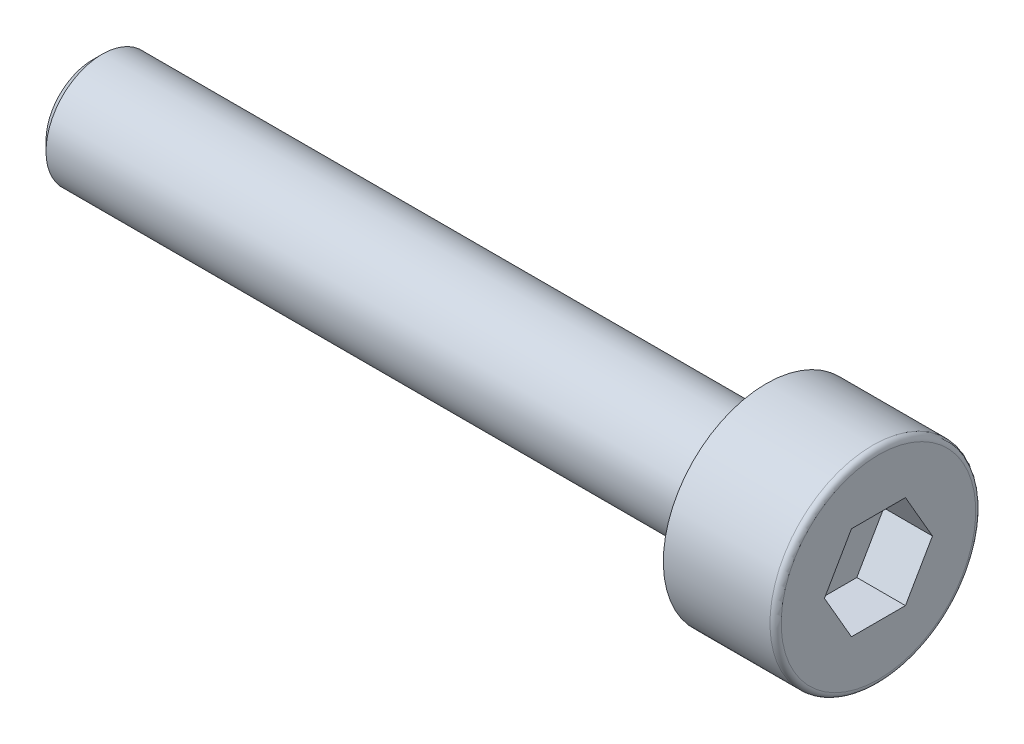
ISO-10303-21;
HEADER;
FILE_DESCRIPTION(('STEP AP214'),'2;1');
FILE_NAME('part.step','',(''),(''),'','','');
FILE_SCHEMA(('AUTOMOTIVE_DESIGN { 1 0 10303 214 1 1 1 1 }'));
ENDSEC;
DATA;
#1=APPLICATION_CONTEXT('core data for automotive mechanical design processes');
#2=APPLICATION_PROTOCOL_DEFINITION('international standard','automotive_design',2000,#1);
#3=PRODUCT_CONTEXT('',#1,'mechanical');
#4=PRODUCT('Part','Part','',(#3));
#5=PRODUCT_RELATED_PRODUCT_CATEGORY('part','',(#4));
#6=PRODUCT_DEFINITION_FORMATION('','',#4);
#7=PRODUCT_DEFINITION_CONTEXT('part definition',#1,'design');
#8=PRODUCT_DEFINITION('design','',#6,#7);
#9=PRODUCT_DEFINITION_SHAPE('','',#8);
#10=(LENGTH_UNIT() NAMED_UNIT(*) SI_UNIT(.MILLI.,.METRE.));
#11=(NAMED_UNIT(*) PLANE_ANGLE_UNIT() SI_UNIT($,.RADIAN.));
#12=(NAMED_UNIT(*) SI_UNIT($,.STERADIAN.) SOLID_ANGLE_UNIT());
#13=UNCERTAINTY_MEASURE_WITH_UNIT(LENGTH_MEASURE(1.E-05),#10,'distance_accuracy_value','');
#14=(GEOMETRIC_REPRESENTATION_CONTEXT(3) GLOBAL_UNCERTAINTY_ASSIGNED_CONTEXT((#13)) GLOBAL_UNIT_ASSIGNED_CONTEXT((#10,
#11,#12)) REPRESENTATION_CONTEXT('',''));
#15=CARTESIAN_POINT('',(0.,0.,0.));
#16=DIRECTION('',(0.,0.,1.));
#17=DIRECTION('',(1.,0.,0.));
#18=AXIS2_PLACEMENT_3D('',#15,#16,#17);
#19=CARTESIAN_POINT('',(0.,0.,0.));
#20=DIRECTION('',(1.,0.,0.));
#21=DIRECTION('',(0.,1.,0.));
#22=AXIS2_PLACEMENT_3D('',#19,#20,#21);
#23=PLANE('',#22);
#24=DIRECTION('',(0.,-0.866025403784439,0.5));
#25=VECTOR('',#24,1.);
#26=CARTESIAN_POINT('',(0.,1.25,0.721687836487035));
#27=LINE('',#26,#25);
#28=CARTESIAN_POINT('',(0.,1.25,0.721687836487035));
#29=VERTEX_POINT('',#28);
#30=CARTESIAN_POINT('',(0.,0.,1.44337567297407));
#31=VERTEX_POINT('',#30);
#32=EDGE_CURVE('E31',#29,#31,#27,.T.);
#33=ORIENTED_EDGE('',*,*,#32,.F.);
#34=DIRECTION('',(0.,0.,1.));
#35=VECTOR('',#34,1.);
#36=CARTESIAN_POINT('',(0.,1.25,-0.721687836487035));
#37=LINE('',#36,#35);
#38=CARTESIAN_POINT('',(0.,1.25,-0.721687836487035));
#39=VERTEX_POINT('',#38);
#40=EDGE_CURVE('E114',#39,#29,#37,.T.);
#41=ORIENTED_EDGE('',*,*,#40,.F.);
#42=DIRECTION('',(0.,0.866025403784439,0.5));
#43=VECTOR('',#42,1.);
#44=CARTESIAN_POINT('',(0.,0.,-1.44337567297406));
#45=LINE('',#44,#43);
#46=CARTESIAN_POINT('',(0.,0.,-1.44337567297406));
#47=VERTEX_POINT('',#46);
#48=EDGE_CURVE('E112',#47,#39,#45,.T.);
#49=ORIENTED_EDGE('',*,*,#48,.F.);
#50=DIRECTION('',(0.,0.866025403784439,-0.5));
#51=VECTOR('',#50,1.);
#52=CARTESIAN_POINT('',(0.,-1.25,-0.721687836487029));
#53=LINE('',#52,#51);
#54=CARTESIAN_POINT('',(0.,-1.25,-0.721687836487029));
#55=VERTEX_POINT('',#54);
#56=EDGE_CURVE('E79',#55,#47,#53,.T.);
#57=ORIENTED_EDGE('',*,*,#56,.F.);
#58=DIRECTION('',(0.,0.,-1.));
#59=VECTOR('',#58,1.);
#60=CARTESIAN_POINT('',(0.,-1.25,0.721687836487035));
#61=LINE('',#60,#59);
#62=CARTESIAN_POINT('',(0.,-1.25,0.721687836487035));
#63=VERTEX_POINT('',#62);
#64=EDGE_CURVE('E108',#63,#55,#61,.T.);
#65=ORIENTED_EDGE('',*,*,#64,.F.);
#66=DIRECTION('',(0.,-0.866025403784439,-0.5));
#67=VECTOR('',#66,1.);
#68=CARTESIAN_POINT('',(0.,0.,1.44337567297407));
#69=LINE('',#68,#67);
#70=EDGE_CURVE('E105',#31,#63,#69,.T.);
#71=ORIENTED_EDGE('',*,*,#70,.F.);
#72=EDGE_LOOP('',(#33,#41,#49,#57,#65,#71));
#73=FACE_BOUND('',#72,.T.);
#74=CARTESIAN_POINT('',(0.,0.,0.));
#75=DIRECTION('',(1.,0.,0.));
#76=DIRECTION('',(0.,1.,0.));
#77=AXIS2_PLACEMENT_3D('',#74,#75,#76);
#78=CIRCLE('',#77,2.6);
#79=CARTESIAN_POINT('',(0.,2.6,0.));
#80=VERTEX_POINT('',#79);
#81=EDGE_CURVE('E132',#80,#80,#78,.T.);
#82=ORIENTED_EDGE('',*,*,#81,.T.);
#83=EDGE_LOOP('',(#82));
#84=FACE_BOUND('',#83,.T.);
#85=ADVANCED_FACE('F16',(#73,#84),#23,.T.);
#86=CARTESIAN_POINT('',(-0.15,0.,0.));
#87=DIRECTION('',(1.,0.,0.));
#88=DIRECTION('',(0.,1.,0.));
#89=AXIS2_PLACEMENT_3D('',#86,#87,#88);
#90=TOROIDAL_SURFACE('',#89,2.6,0.15);
#91=CARTESIAN_POINT('',(-0.15,0.,0.));
#92=DIRECTION('',(1.,0.,0.));
#93=DIRECTION('',(0.,1.,0.));
#94=AXIS2_PLACEMENT_3D('',#91,#92,#93);
#95=CIRCLE('',#94,2.75);
#96=CARTESIAN_POINT('',(-0.15,2.75,0.));
#97=VERTEX_POINT('',#96);
#98=EDGE_CURVE('E129',#97,#97,#95,.T.);
#99=ORIENTED_EDGE('',*,*,#98,.T.);
#100=EDGE_LOOP('',(#99));
#101=FACE_BOUND('',#100,.T.);
#102=ORIENTED_EDGE('',*,*,#81,.F.);
#103=EDGE_LOOP('',(#102));
#104=FACE_BOUND('',#103,.T.);
#105=ADVANCED_FACE('F151',(#101,#104),#90,.T.);
#106=CARTESIAN_POINT('',(0.,0.,0.));
#107=DIRECTION('',(1.,0.,0.));
#108=DIRECTION('',(0.,1.,0.));
#109=AXIS2_PLACEMENT_3D('',#106,#107,#108);
#110=CYLINDRICAL_SURFACE('',#109,2.75);
#111=CARTESIAN_POINT('',(-3.,0.,0.));
#112=DIRECTION('',(1.,0.,0.));
#113=DIRECTION('',(0.,1.,0.));
#114=AXIS2_PLACEMENT_3D('',#111,#112,#113);
#115=CIRCLE('',#114,2.75);
#116=CARTESIAN_POINT('',(-3.,2.75,0.));
#117=VERTEX_POINT('',#116);
#118=EDGE_CURVE('E126',#117,#117,#115,.T.);
#119=ORIENTED_EDGE('',*,*,#118,.T.);
#120=EDGE_LOOP('',(#119));
#121=FACE_BOUND('',#120,.T.);
#122=ORIENTED_EDGE('',*,*,#98,.F.);
#123=EDGE_LOOP('',(#122));
#124=FACE_BOUND('',#123,.T.);
#125=ADVANCED_FACE('F157',(#121,#124),#110,.T.);
#126=CARTESIAN_POINT('',(-3.,2.75,0.));
#127=DIRECTION('',(-1.,0.,0.));
#128=DIRECTION('',(0.,-1.,0.));
#129=AXIS2_PLACEMENT_3D('',#126,#127,#128);
#130=PLANE('',#129);
#131=CARTESIAN_POINT('',(-3.,0.,0.));
#132=DIRECTION('',(1.,0.,0.));
#133=DIRECTION('',(0.,1.,0.));
#134=AXIS2_PLACEMENT_3D('',#131,#132,#133);
#135=CIRCLE('',#134,1.5);
#136=CARTESIAN_POINT('',(-3.,1.5,0.));
#137=VERTEX_POINT('',#136);
#138=EDGE_CURVE('E118',#137,#137,#135,.T.);
#139=ORIENTED_EDGE('',*,*,#138,.T.);
#140=EDGE_LOOP('',(#139));
#141=FACE_BOUND('',#140,.T.);
#142=ORIENTED_EDGE('',*,*,#118,.F.);
#143=EDGE_LOOP('',(#142));
#144=FACE_BOUND('',#143,.T.);
#145=ADVANCED_FACE('F164',(#141,#144),#130,.T.);
#146=CARTESIAN_POINT('',(0.,0.,0.));
#147=DIRECTION('',(1.,0.,0.));
#148=DIRECTION('',(0.,1.,0.));
#149=AXIS2_PLACEMENT_3D('',#146,#147,#148);
#150=CYLINDRICAL_SURFACE('',#149,1.5);
#151=CARTESIAN_POINT('',(-20.75,0.,0.));
#152=DIRECTION('',(-1.,0.,0.));
#153=DIRECTION('',(0.,-1.,0.));
#154=AXIS2_PLACEMENT_3D('',#151,#152,#153);
#155=CIRCLE('',#154,1.5);
#156=CARTESIAN_POINT('',(-20.75,-1.5,0.));
#157=VERTEX_POINT('',#156);
#158=EDGE_CURVE('E24',#157,#157,#155,.F.);
#159=ORIENTED_EDGE('',*,*,#158,.T.);
#160=EDGE_LOOP('',(#159));
#161=FACE_BOUND('',#160,.T.);
#162=ORIENTED_EDGE('',*,*,#138,.F.);
#163=EDGE_LOOP('',(#162));
#164=FACE_BOUND('',#163,.T.);
#165=ADVANCED_FACE('F137',(#161,#164),#150,.T.);
#166=CARTESIAN_POINT('',(-21.,1.5,0.));
#167=DIRECTION('',(-1.,0.,0.));
#168=DIRECTION('',(0.,-1.,0.));
#169=AXIS2_PLACEMENT_3D('',#166,#167,#168);
#170=PLANE('',#169);
#171=CARTESIAN_POINT('',(-21.,0.,0.));
#172=DIRECTION('',(-1.,0.,0.));
#173=DIRECTION('',(0.,-1.,0.));
#174=AXIS2_PLACEMENT_3D('',#171,#172,#173);
#175=CIRCLE('',#174,1.25);
#176=CARTESIAN_POINT('',(-21.,-1.25,0.));
#177=VERTEX_POINT('',#176);
#178=EDGE_CURVE('E10',#177,#177,#175,.T.);
#179=ORIENTED_EDGE('',*,*,#178,.T.);
#180=EDGE_LOOP('',(#179));
#181=FACE_BOUND('',#180,.T.);
#182=ADVANCED_FACE('F171',(#181),#170,.T.);
#183=CARTESIAN_POINT('',(-1.3,1.25,0.721687836487035));
#184=DIRECTION('',(0.,0.5,0.866025403784439));
#185=DIRECTION('',(0.,-0.866025403784439,0.5));
#186=AXIS2_PLACEMENT_3D('',#183,#184,#185);
#187=PLANE('',#186);
#188=ORIENTED_EDGE('',*,*,#32,.T.);
#189=DIRECTION('',(1.,0.,0.));
#190=VECTOR('',#189,1.);
#191=CARTESIAN_POINT('',(-1.3,0.,1.44337567297407));
#192=LINE('',#191,#190);
#193=CARTESIAN_POINT('',(-1.3,0.,1.44337567297407));
#194=VERTEX_POINT('',#193);
#195=EDGE_CURVE('E61',#194,#31,#192,.T.);
#196=ORIENTED_EDGE('',*,*,#195,.F.);
#197=DIRECTION('',(0.,-0.866025403784439,0.5));
#198=VECTOR('',#197,1.);
#199=CARTESIAN_POINT('',(-1.3,1.25,0.721687836487035));
#200=LINE('',#199,#198);
#201=CARTESIAN_POINT('',(-1.3,1.25,0.721687836487035));
#202=VERTEX_POINT('',#201);
#203=EDGE_CURVE('E116',#202,#194,#200,.T.);
#204=ORIENTED_EDGE('',*,*,#203,.F.);
#205=DIRECTION('',(1.,0.,0.));
#206=VECTOR('',#205,1.);
#207=CARTESIAN_POINT('',(-1.3,1.25,0.721687836487035));
#208=LINE('',#207,#206);
#209=EDGE_CURVE('E39',#202,#29,#208,.T.);
#210=ORIENTED_EDGE('',*,*,#209,.T.);
#211=EDGE_LOOP('',(#188,#196,#204,#210));
#212=FACE_BOUND('',#211,.T.);
#213=ADVANCED_FACE('F174',(#212),#187,.F.);
#214=CARTESIAN_POINT('',(-1.3,1.25,-0.721687836487035));
#215=DIRECTION('',(0.,1.,0.));
#216=DIRECTION('',(-1.,0.,0.));
#217=AXIS2_PLACEMENT_3D('',#214,#215,#216);
#218=PLANE('',#217);
#219=ORIENTED_EDGE('',*,*,#40,.T.);
#220=ORIENTED_EDGE('',*,*,#209,.F.);
#221=DIRECTION('',(0.,0.,1.));
#222=VECTOR('',#221,1.);
#223=CARTESIAN_POINT('',(-1.3,1.25,-0.721687836487035));
#224=LINE('',#223,#222);
#225=CARTESIAN_POINT('',(-1.3,1.25,-0.721687836487035));
#226=VERTEX_POINT('',#225);
#227=EDGE_CURVE('E91',#226,#202,#224,.T.);
#228=ORIENTED_EDGE('',*,*,#227,.F.);
#229=DIRECTION('',(1.,0.,0.));
#230=VECTOR('',#229,1.);
#231=CARTESIAN_POINT('',(-1.3,1.25,-0.721687836487035));
#232=LINE('',#231,#230);
#233=EDGE_CURVE('E83',#226,#39,#232,.T.);
#234=ORIENTED_EDGE('',*,*,#233,.T.);
#235=EDGE_LOOP('',(#219,#220,#228,#234));
#236=FACE_BOUND('',#235,.T.);
#237=ADVANCED_FACE('F178',(#236),#218,.F.);
#238=CARTESIAN_POINT('',(-1.3,0.,-1.44337567297406));
#239=DIRECTION('',(0.,0.5,-0.866025403784439));
#240=DIRECTION('',(0.,0.866025403784439,0.5));
#241=AXIS2_PLACEMENT_3D('',#238,#239,#240);
#242=PLANE('',#241);
#243=ORIENTED_EDGE('',*,*,#48,.T.);
#244=ORIENTED_EDGE('',*,*,#233,.F.);
#245=DIRECTION('',(0.,0.866025403784439,0.5));
#246=VECTOR('',#245,1.);
#247=CARTESIAN_POINT('',(-1.3,0.,-1.44337567297406));
#248=LINE('',#247,#246);
#249=CARTESIAN_POINT('',(-1.3,0.,-1.44337567297406));
#250=VERTEX_POINT('',#249);
#251=EDGE_CURVE('E87',#250,#226,#248,.T.);
#252=ORIENTED_EDGE('',*,*,#251,.F.);
#253=DIRECTION('',(1.,0.,0.));
#254=VECTOR('',#253,1.);
#255=CARTESIAN_POINT('',(-1.3,0.,-1.44337567297406));
#256=LINE('',#255,#254);
#257=EDGE_CURVE('E72',#250,#47,#256,.T.);
#258=ORIENTED_EDGE('',*,*,#257,.T.);
#259=EDGE_LOOP('',(#243,#244,#252,#258));
#260=FACE_BOUND('',#259,.T.);
#261=ADVANCED_FACE('F88',(#260),#242,.F.);
#262=CARTESIAN_POINT('',(-1.3,-1.25,-0.721687836487029));
#263=DIRECTION('',(0.,-0.5,-0.866025403784439));
#264=DIRECTION('',(0.,0.866025403784439,-0.5));
#265=AXIS2_PLACEMENT_3D('',#262,#263,#264);
#266=PLANE('',#265);
#267=ORIENTED_EDGE('',*,*,#56,.T.);
#268=ORIENTED_EDGE('',*,*,#257,.F.);
#269=DIRECTION('',(0.,0.866025403784439,-0.5));
#270=VECTOR('',#269,1.);
#271=CARTESIAN_POINT('',(-1.3,-1.25,-0.721687836487029));
#272=LINE('',#271,#270);
#273=CARTESIAN_POINT('',(-1.3,-1.25,-0.721687836487029));
#274=VERTEX_POINT('',#273);
#275=EDGE_CURVE('E76',#274,#250,#272,.T.);
#276=ORIENTED_EDGE('',*,*,#275,.F.);
#277=DIRECTION('',(1.,0.,0.));
#278=VECTOR('',#277,1.);
#279=CARTESIAN_POINT('',(-1.3,-1.25,-0.721687836487029));
#280=LINE('',#279,#278);
#281=EDGE_CURVE('E84',#274,#55,#280,.T.);
#282=ORIENTED_EDGE('',*,*,#281,.T.);
#283=EDGE_LOOP('',(#267,#268,#276,#282));
#284=FACE_BOUND('',#283,.T.);
#285=ADVANCED_FACE('F74',(#284),#266,.F.);
#286=CARTESIAN_POINT('',(-1.3,-1.25,0.721687836487035));
#287=DIRECTION('',(0.,-1.,0.));
#288=DIRECTION('',(0.,0.,-1.));
#289=AXIS2_PLACEMENT_3D('',#286,#287,#288);
#290=PLANE('',#289);
#291=ORIENTED_EDGE('',*,*,#64,.T.);
#292=ORIENTED_EDGE('',*,*,#281,.F.);
#293=DIRECTION('',(0.,0.,-1.));
#294=VECTOR('',#293,1.);
#295=CARTESIAN_POINT('',(-1.3,-1.25,0.721687836487035));
#296=LINE('',#295,#294);
#297=CARTESIAN_POINT('',(-1.3,-1.25,0.721687836487035));
#298=VERTEX_POINT('',#297);
#299=EDGE_CURVE('E97',#298,#274,#296,.T.);
#300=ORIENTED_EDGE('',*,*,#299,.F.);
#301=DIRECTION('',(1.,0.,0.));
#302=VECTOR('',#301,1.);
#303=CARTESIAN_POINT('',(-1.3,-1.25,0.721687836487035));
#304=LINE('',#303,#302);
#305=EDGE_CURVE('E121',#298,#63,#304,.T.);
#306=ORIENTED_EDGE('',*,*,#305,.T.);
#307=EDGE_LOOP('',(#291,#292,#300,#306));
#308=FACE_BOUND('',#307,.T.);
#309=ADVANCED_FACE('F181',(#308),#290,.F.);
#310=CARTESIAN_POINT('',(-1.3,0.,1.44337567297407));
#311=DIRECTION('',(0.,-0.5,0.866025403784439));
#312=DIRECTION('',(0.,-0.866025403784439,-0.5));
#313=AXIS2_PLACEMENT_3D('',#310,#311,#312);
#314=PLANE('',#313);
#315=ORIENTED_EDGE('',*,*,#70,.T.);
#316=ORIENTED_EDGE('',*,*,#305,.F.);
#317=DIRECTION('',(0.,-0.866025403784439,-0.5));
#318=VECTOR('',#317,1.);
#319=CARTESIAN_POINT('',(-1.3,0.,1.44337567297407));
#320=LINE('',#319,#318);
#321=EDGE_CURVE('E99',#194,#298,#320,.T.);
#322=ORIENTED_EDGE('',*,*,#321,.F.);
#323=ORIENTED_EDGE('',*,*,#195,.T.);
#324=EDGE_LOOP('',(#315,#316,#322,#323));
#325=FACE_BOUND('',#324,.T.);
#326=ADVANCED_FACE('F147',(#325),#314,.F.);
#327=CARTESIAN_POINT('',(-1.3,0.,1.44337567297407));
#328=DIRECTION('',(1.,0.,0.));
#329=DIRECTION('',(0.,1.,0.));
#330=AXIS2_PLACEMENT_3D('',#327,#328,#329);
#331=PLANE('',#330);
#332=ORIENTED_EDGE('',*,*,#203,.T.);
#333=ORIENTED_EDGE('',*,*,#321,.T.);
#334=ORIENTED_EDGE('',*,*,#299,.T.);
#335=ORIENTED_EDGE('',*,*,#275,.T.);
#336=ORIENTED_EDGE('',*,*,#251,.T.);
#337=ORIENTED_EDGE('',*,*,#227,.T.);
#338=EDGE_LOOP('',(#332,#333,#334,#335,#336,#337));
#339=FACE_BOUND('',#338,.T.);
#340=ADVANCED_FACE('F94',(#339),#331,.T.);
#341=CARTESIAN_POINT('',(-20.75,0.,0.));
#342=DIRECTION('',(1.,0.,0.));
#343=DIRECTION('',(0.,1.,0.));
#344=AXIS2_PLACEMENT_3D('',#341,#342,#343);
#345=CONICAL_SURFACE('',#344,1.5,0.785398163397442);
#346=ORIENTED_EDGE('',*,*,#178,.F.);
#347=EDGE_LOOP('',(#346));
#348=FACE_BOUND('',#347,.T.);
#349=ORIENTED_EDGE('',*,*,#158,.F.);
#350=EDGE_LOOP('',(#349));
#351=FACE_BOUND('',#350,.T.);
#352=ADVANCED_FACE('F18',(#348,#351),#345,.T.);
#353=CLOSED_SHELL('',(#85,#105,#125,#145,#165,#182,#213,#237,#261,#285,#309,#326,#340,#352));
#354=MANIFOLD_SOLID_BREP('B1',#353);
#355=ADVANCED_BREP_SHAPE_REPRESENTATION('',(#18,#354),#14);
#356=SHAPE_DEFINITION_REPRESENTATION(#9,#355);
ENDSEC;
END-ISO-10303-21;
